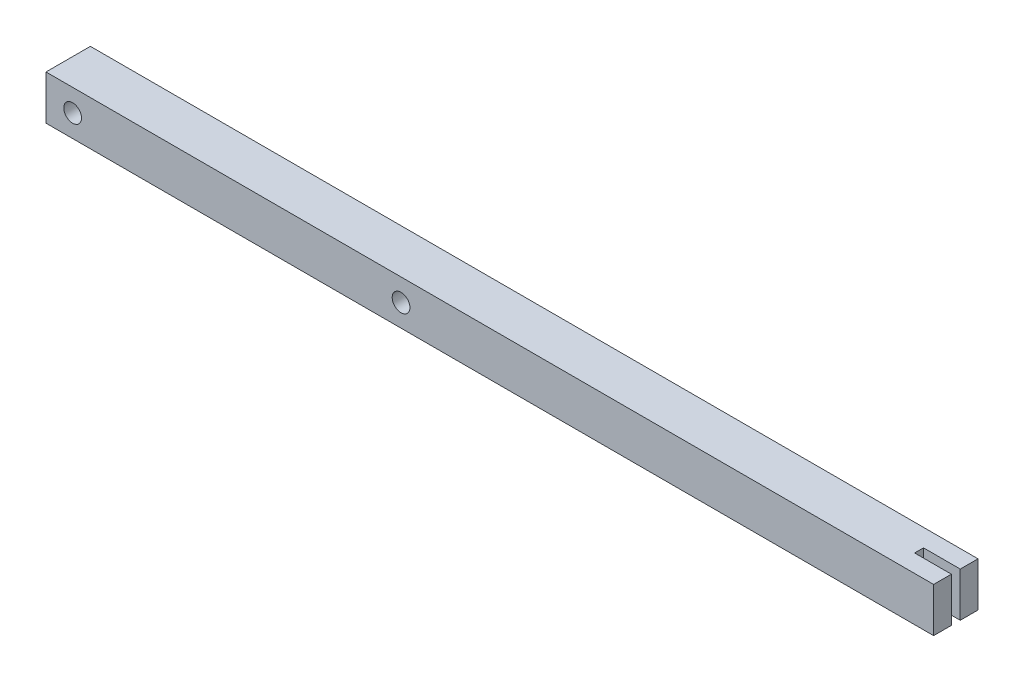
ISO-10303-21;
HEADER;
FILE_DESCRIPTION(('STEP AP214'),'2;1');
FILE_NAME('part.step','',(''),(''),'','','');
FILE_SCHEMA(('AUTOMOTIVE_DESIGN { 1 0 10303 214 1 1 1 1 }'));
ENDSEC;
DATA;
#1=APPLICATION_CONTEXT('core data for automotive mechanical design processes');
#2=APPLICATION_PROTOCOL_DEFINITION('international standard','automotive_design',2000,#1);
#3=PRODUCT_CONTEXT('',#1,'mechanical');
#4=PRODUCT('Part','Part','',(#3));
#5=PRODUCT_RELATED_PRODUCT_CATEGORY('part','',(#4));
#6=PRODUCT_DEFINITION_FORMATION('','',#4);
#7=PRODUCT_DEFINITION_CONTEXT('part definition',#1,'design');
#8=PRODUCT_DEFINITION('design','',#6,#7);
#9=PRODUCT_DEFINITION_SHAPE('','',#8);
#10=(LENGTH_UNIT() NAMED_UNIT(*) SI_UNIT(.MILLI.,.METRE.));
#11=(NAMED_UNIT(*) PLANE_ANGLE_UNIT() SI_UNIT($,.RADIAN.));
#12=(NAMED_UNIT(*) SI_UNIT($,.STERADIAN.) SOLID_ANGLE_UNIT());
#13=UNCERTAINTY_MEASURE_WITH_UNIT(LENGTH_MEASURE(1.E-05),#10,'distance_accuracy_value','');
#14=(GEOMETRIC_REPRESENTATION_CONTEXT(3) GLOBAL_UNCERTAINTY_ASSIGNED_CONTEXT((#13)) GLOBAL_UNIT_ASSIGNED_CONTEXT((#10,
#11,#12)) REPRESENTATION_CONTEXT('',''));
#15=CARTESIAN_POINT('',(0.,0.,0.));
#16=DIRECTION('',(0.,0.,1.));
#17=DIRECTION('',(1.,0.,0.));
#18=AXIS2_PLACEMENT_3D('',#15,#16,#17);
#19=CARTESIAN_POINT('',(250.,25.,12.5));
#20=DIRECTION('',(-1.,0.,0.));
#21=DIRECTION('',(0.,0.,1.));
#22=AXIS2_PLACEMENT_3D('',#19,#20,#21);
#23=PLANE('',#22);
#24=DIRECTION('',(0.,0.,-1.));
#25=VECTOR('',#24,1.);
#26=CARTESIAN_POINT('',(250.,25.,12.5));
#27=LINE('',#26,#25);
#28=CARTESIAN_POINT('',(250.,25.,-2.5));
#29=VERTEX_POINT('',#28);
#30=CARTESIAN_POINT('',(250.,25.,-12.5));
#31=VERTEX_POINT('',#30);
#32=EDGE_CURVE('E155',#29,#31,#27,.T.);
#33=ORIENTED_EDGE('',*,*,#32,.F.);
#34=DIRECTION('',(0.,-1.,0.));
#35=VECTOR('',#34,1.);
#36=CARTESIAN_POINT('',(250.,25.,-2.5));
#37=LINE('',#36,#35);
#38=CARTESIAN_POINT('',(250.,0.,-2.5));
#39=VERTEX_POINT('',#38);
#40=EDGE_CURVE('E136',#29,#39,#37,.T.);
#41=ORIENTED_EDGE('',*,*,#40,.T.);
#42=DIRECTION('',(0.,0.,-1.));
#43=VECTOR('',#42,1.);
#44=CARTESIAN_POINT('',(250.,0.,12.5));
#45=LINE('',#44,#43);
#46=CARTESIAN_POINT('',(250.,0.,-12.5));
#47=VERTEX_POINT('',#46);
#48=EDGE_CURVE('E165',#39,#47,#45,.T.);
#49=ORIENTED_EDGE('',*,*,#48,.T.);
#50=DIRECTION('',(0.,-1.,0.));
#51=VECTOR('',#50,1.);
#52=CARTESIAN_POINT('',(250.,25.,-12.5));
#53=LINE('',#52,#51);
#54=EDGE_CURVE('E170',#31,#47,#53,.T.);
#55=ORIENTED_EDGE('',*,*,#54,.F.);
#56=EDGE_LOOP('',(#33,#41,#49,#55));
#57=FACE_BOUND('',#56,.T.);
#58=ADVANCED_FACE('F33',(#57),#23,.F.);
#59=CARTESIAN_POINT('',(-250.,25.,12.5));
#60=DIRECTION('',(1.,0.,0.));
#61=DIRECTION('',(0.,0.,-1.));
#62=AXIS2_PLACEMENT_3D('',#59,#60,#61);
#63=PLANE('',#62);
#64=DIRECTION('',(0.,0.,1.));
#65=VECTOR('',#64,1.);
#66=CARTESIAN_POINT('',(-250.,0.,12.5));
#67=LINE('',#66,#65);
#68=CARTESIAN_POINT('',(-250.,0.,-12.5));
#69=VERTEX_POINT('',#68);
#70=CARTESIAN_POINT('',(-250.,0.,12.5));
#71=VERTEX_POINT('',#70);
#72=EDGE_CURVE('E149',#69,#71,#67,.T.);
#73=ORIENTED_EDGE('',*,*,#72,.T.);
#74=DIRECTION('',(0.,-1.,0.));
#75=VECTOR('',#74,1.);
#76=CARTESIAN_POINT('',(-250.,25.,12.5));
#77=LINE('',#76,#75);
#78=CARTESIAN_POINT('',(-250.,25.,12.5));
#79=VERTEX_POINT('',#78);
#80=EDGE_CURVE('E41',#79,#71,#77,.T.);
#81=ORIENTED_EDGE('',*,*,#80,.F.);
#82=DIRECTION('',(0.,0.,1.));
#83=VECTOR('',#82,1.);
#84=CARTESIAN_POINT('',(-250.,25.,12.5));
#85=LINE('',#84,#83);
#86=CARTESIAN_POINT('',(-250.,25.,-12.5));
#87=VERTEX_POINT('',#86);
#88=EDGE_CURVE('E152',#87,#79,#85,.T.);
#89=ORIENTED_EDGE('',*,*,#88,.F.);
#90=DIRECTION('',(0.,-1.,0.));
#91=VECTOR('',#90,1.);
#92=CARTESIAN_POINT('',(-250.,25.,-12.5));
#93=LINE('',#92,#91);
#94=EDGE_CURVE('E160',#87,#69,#93,.T.);
#95=ORIENTED_EDGE('',*,*,#94,.T.);
#96=EDGE_LOOP('',(#73,#81,#89,#95));
#97=FACE_BOUND('',#96,.T.);
#98=ADVANCED_FACE('F35',(#97),#63,.F.);
#99=CARTESIAN_POINT('',(250.,25.,12.5));
#100=DIRECTION('',(0.,0.,-1.));
#101=DIRECTION('',(-1.,0.,0.));
#102=AXIS2_PLACEMENT_3D('',#99,#100,#101);
#103=PLANE('',#102);
#104=CARTESIAN_POINT('',(-50.,12.5,12.5));
#105=DIRECTION('',(0.,0.,1.));
#106=DIRECTION('',(1.,0.,0.));
#107=AXIS2_PLACEMENT_3D('',#104,#105,#106);
#108=CIRCLE('',#107,4.99999999999999);
#109=CARTESIAN_POINT('',(-45.,12.5,12.5));
#110=VERTEX_POINT('',#109);
#111=EDGE_CURVE('E139',#110,#110,#108,.T.);
#112=ORIENTED_EDGE('',*,*,#111,.F.);
#113=EDGE_LOOP('',(#112));
#114=FACE_BOUND('',#113,.T.);
#115=CARTESIAN_POINT('',(-235.,12.5,12.5));
#116=DIRECTION('',(0.,0.,1.));
#117=DIRECTION('',(1.,0.,0.));
#118=AXIS2_PLACEMENT_3D('',#115,#116,#117);
#119=CIRCLE('',#118,4.99999999999999);
#120=CARTESIAN_POINT('',(-230.,12.5,12.5));
#121=VERTEX_POINT('',#120);
#122=EDGE_CURVE('E143',#121,#121,#119,.T.);
#123=ORIENTED_EDGE('',*,*,#122,.F.);
#124=EDGE_LOOP('',(#123));
#125=FACE_BOUND('',#124,.T.);
#126=DIRECTION('',(1.,0.,0.));
#127=VECTOR('',#126,1.);
#128=CARTESIAN_POINT('',(250.,0.,12.5));
#129=LINE('',#128,#127);
#130=CARTESIAN_POINT('',(250.,0.,12.5));
#131=VERTEX_POINT('',#130);
#132=EDGE_CURVE('E163',#71,#131,#129,.T.);
#133=ORIENTED_EDGE('',*,*,#132,.T.);
#134=DIRECTION('',(0.,-1.,0.));
#135=VECTOR('',#134,1.);
#136=CARTESIAN_POINT('',(250.,25.,12.5));
#137=LINE('',#136,#135);
#138=CARTESIAN_POINT('',(250.,25.,12.5));
#139=VERTEX_POINT('',#138);
#140=EDGE_CURVE('E172',#139,#131,#137,.T.);
#141=ORIENTED_EDGE('',*,*,#140,.F.);
#142=DIRECTION('',(1.,0.,0.));
#143=VECTOR('',#142,1.);
#144=CARTESIAN_POINT('',(250.,25.,12.5));
#145=LINE('',#144,#143);
#146=EDGE_CURVE('E86',#79,#139,#145,.T.);
#147=ORIENTED_EDGE('',*,*,#146,.F.);
#148=ORIENTED_EDGE('',*,*,#80,.T.);
#149=EDGE_LOOP('',(#133,#141,#147,#148));
#150=FACE_BOUND('',#149,.T.);
#151=ADVANCED_FACE('F175',(#114,#125,#150),#103,.F.);
#152=CARTESIAN_POINT('',(250.,0.,2.5));
#153=VERTEX_POINT('',#152);
#154=EDGE_CURVE('E166',#131,#153,#45,.T.);
#155=ORIENTED_EDGE('',*,*,#154,.T.);
#156=DIRECTION('',(0.,1.,0.));
#157=VECTOR('',#156,1.);
#158=CARTESIAN_POINT('',(250.,25.,2.5));
#159=LINE('',#158,#157);
#160=CARTESIAN_POINT('',(250.,25.,2.5));
#161=VERTEX_POINT('',#160);
#162=EDGE_CURVE('E48',#153,#161,#159,.T.);
#163=ORIENTED_EDGE('',*,*,#162,.T.);
#164=EDGE_CURVE('E156',#139,#161,#27,.T.);
#165=ORIENTED_EDGE('',*,*,#164,.F.);
#166=ORIENTED_EDGE('',*,*,#140,.T.);
#167=EDGE_LOOP('',(#155,#163,#165,#166));
#168=FACE_BOUND('',#167,.T.);
#169=ADVANCED_FACE('F180',(#168),#23,.F.);
#170=CARTESIAN_POINT('',(250.,25.,-12.5));
#171=DIRECTION('',(0.,0.,1.));
#172=DIRECTION('',(1.,0.,0.));
#173=AXIS2_PLACEMENT_3D('',#170,#171,#172);
#174=PLANE('',#173);
#175=CARTESIAN_POINT('',(-50.,12.5,-12.5));
#176=DIRECTION('',(0.,0.,1.));
#177=DIRECTION('',(1.,0.,0.));
#178=AXIS2_PLACEMENT_3D('',#175,#176,#177);
#179=CIRCLE('',#178,4.99999999999999);
#180=CARTESIAN_POINT('',(-45.,12.5,-12.5));
#181=VERTEX_POINT('',#180);
#182=EDGE_CURVE('E140',#181,#181,#179,.T.);
#183=ORIENTED_EDGE('',*,*,#182,.T.);
#184=EDGE_LOOP('',(#183));
#185=FACE_BOUND('',#184,.T.);
#186=CARTESIAN_POINT('',(-235.,12.5,-12.5));
#187=DIRECTION('',(0.,0.,1.));
#188=DIRECTION('',(1.,0.,0.));
#189=AXIS2_PLACEMENT_3D('',#186,#187,#188);
#190=CIRCLE('',#189,4.99999999999999);
#191=CARTESIAN_POINT('',(-230.,12.5,-12.5));
#192=VERTEX_POINT('',#191);
#193=EDGE_CURVE('E146',#192,#192,#190,.T.);
#194=ORIENTED_EDGE('',*,*,#193,.T.);
#195=EDGE_LOOP('',(#194));
#196=FACE_BOUND('',#195,.T.);
#197=DIRECTION('',(-1.,0.,0.));
#198=VECTOR('',#197,1.);
#199=CARTESIAN_POINT('',(250.,0.,-12.5));
#200=LINE('',#199,#198);
#201=EDGE_CURVE('E78',#47,#69,#200,.T.);
#202=ORIENTED_EDGE('',*,*,#201,.T.);
#203=ORIENTED_EDGE('',*,*,#94,.F.);
#204=DIRECTION('',(-1.,0.,0.));
#205=VECTOR('',#204,1.);
#206=CARTESIAN_POINT('',(250.,25.,-12.5));
#207=LINE('',#206,#205);
#208=EDGE_CURVE('E57',#31,#87,#207,.T.);
#209=ORIENTED_EDGE('',*,*,#208,.F.);
#210=ORIENTED_EDGE('',*,*,#54,.T.);
#211=EDGE_LOOP('',(#202,#203,#209,#210));
#212=FACE_BOUND('',#211,.T.);
#213=ADVANCED_FACE('F188',(#185,#196,#212),#174,.F.);
#214=CARTESIAN_POINT('',(0.,25.,0.));
#215=DIRECTION('',(0.,1.,0.));
#216=DIRECTION('',(0.,0.,1.));
#217=AXIS2_PLACEMENT_3D('',#214,#215,#216);
#218=PLANE('',#217);
#219=DIRECTION('',(-1.,0.,0.));
#220=VECTOR('',#219,1.);
#221=CARTESIAN_POINT('',(229.29580242492,25.,-2.5));
#222=LINE('',#221,#220);
#223=CARTESIAN_POINT('',(229.29580242492,25.,-2.5));
#224=VERTEX_POINT('',#223);
#225=EDGE_CURVE('E127',#29,#224,#222,.T.);
#226=ORIENTED_EDGE('',*,*,#225,.F.);
#227=ORIENTED_EDGE('',*,*,#32,.T.);
#228=ORIENTED_EDGE('',*,*,#208,.T.);
#229=ORIENTED_EDGE('',*,*,#88,.T.);
#230=ORIENTED_EDGE('',*,*,#146,.T.);
#231=ORIENTED_EDGE('',*,*,#164,.T.);
#232=DIRECTION('',(1.,0.,0.));
#233=VECTOR('',#232,1.);
#234=CARTESIAN_POINT('',(229.29580242492,25.,2.5));
#235=LINE('',#234,#233);
#236=CARTESIAN_POINT('',(229.29580242492,25.,2.5));
#237=VERTEX_POINT('',#236);
#238=EDGE_CURVE('E129',#237,#161,#235,.T.);
#239=ORIENTED_EDGE('',*,*,#238,.F.);
#240=DIRECTION('',(0.,0.,1.));
#241=VECTOR('',#240,1.);
#242=CARTESIAN_POINT('',(229.29580242492,25.,2.5));
#243=LINE('',#242,#241);
#244=EDGE_CURVE('E115',#224,#237,#243,.T.);
#245=ORIENTED_EDGE('',*,*,#244,.F.);
#246=EDGE_LOOP('',(#226,#227,#228,#229,#230,#231,#239,#245));
#247=FACE_BOUND('',#246,.T.);
#248=ADVANCED_FACE('F183',(#247),#218,.T.);
#249=CARTESIAN_POINT('',(0.,0.,0.));
#250=DIRECTION('',(0.,1.,0.));
#251=DIRECTION('',(0.,0.,1.));
#252=AXIS2_PLACEMENT_3D('',#249,#250,#251);
#253=PLANE('',#252);
#254=ORIENTED_EDGE('',*,*,#48,.F.);
#255=DIRECTION('',(-1.,0.,0.));
#256=VECTOR('',#255,1.);
#257=CARTESIAN_POINT('',(0.,0.,-2.5));
#258=LINE('',#257,#256);
#259=CARTESIAN_POINT('',(229.29580242492,0.,-2.5));
#260=VERTEX_POINT('',#259);
#261=EDGE_CURVE('E11',#39,#260,#258,.T.);
#262=ORIENTED_EDGE('',*,*,#261,.T.);
#263=DIRECTION('',(0.,0.,1.));
#264=VECTOR('',#263,1.);
#265=CARTESIAN_POINT('',(229.29580242492,0.,2.5));
#266=LINE('',#265,#264);
#267=CARTESIAN_POINT('',(229.29580242492,0.,2.5));
#268=VERTEX_POINT('',#267);
#269=EDGE_CURVE('E113',#260,#268,#266,.T.);
#270=ORIENTED_EDGE('',*,*,#269,.T.);
#271=DIRECTION('',(1.,0.,0.));
#272=VECTOR('',#271,1.);
#273=CARTESIAN_POINT('',(229.29580242492,0.,2.5));
#274=LINE('',#273,#272);
#275=EDGE_CURVE('E118',#268,#153,#274,.T.);
#276=ORIENTED_EDGE('',*,*,#275,.T.);
#277=ORIENTED_EDGE('',*,*,#154,.F.);
#278=ORIENTED_EDGE('',*,*,#132,.F.);
#279=ORIENTED_EDGE('',*,*,#72,.F.);
#280=ORIENTED_EDGE('',*,*,#201,.F.);
#281=EDGE_LOOP('',(#254,#262,#270,#276,#277,#278,#279,#280));
#282=FACE_BOUND('',#281,.T.);
#283=ADVANCED_FACE('F126',(#282),#253,.F.);
#284=CARTESIAN_POINT('',(-235.,12.5,-12.5));
#285=DIRECTION('',(0.,0.,1.));
#286=DIRECTION('',(1.,0.,0.));
#287=AXIS2_PLACEMENT_3D('',#284,#285,#286);
#288=CYLINDRICAL_SURFACE('',#287,4.99999999999999);
#289=ORIENTED_EDGE('',*,*,#193,.F.);
#290=EDGE_LOOP('',(#289));
#291=FACE_BOUND('',#290,.T.);
#292=ORIENTED_EDGE('',*,*,#122,.T.);
#293=EDGE_LOOP('',(#292));
#294=FACE_BOUND('',#293,.T.);
#295=ADVANCED_FACE('F212',(#291,#294),#288,.F.);
#296=CARTESIAN_POINT('',(-50.,12.5,-12.5));
#297=DIRECTION('',(0.,0.,1.));
#298=DIRECTION('',(1.,0.,0.));
#299=AXIS2_PLACEMENT_3D('',#296,#297,#298);
#300=CYLINDRICAL_SURFACE('',#299,4.99999999999999);
#301=ORIENTED_EDGE('',*,*,#182,.F.);
#302=EDGE_LOOP('',(#301));
#303=FACE_BOUND('',#302,.T.);
#304=ORIENTED_EDGE('',*,*,#111,.T.);
#305=EDGE_LOOP('',(#304));
#306=FACE_BOUND('',#305,.T.);
#307=ADVANCED_FACE('F214',(#303,#306),#300,.F.);
#308=CARTESIAN_POINT('',(229.29580242492,0.,-2.5));
#309=DIRECTION('',(0.,0.,-1.));
#310=DIRECTION('',(-1.,0.,0.));
#311=AXIS2_PLACEMENT_3D('',#308,#309,#310);
#312=PLANE('',#311);
#313=ORIENTED_EDGE('',*,*,#225,.T.);
#314=DIRECTION('',(0.,1.,0.));
#315=VECTOR('',#314,1.);
#316=CARTESIAN_POINT('',(229.29580242492,0.,-2.5));
#317=LINE('',#316,#315);
#318=EDGE_CURVE('E117',#260,#224,#317,.T.);
#319=ORIENTED_EDGE('',*,*,#318,.F.);
#320=ORIENTED_EDGE('',*,*,#261,.F.);
#321=ORIENTED_EDGE('',*,*,#40,.F.);
#322=EDGE_LOOP('',(#313,#319,#320,#321));
#323=FACE_BOUND('',#322,.T.);
#324=ADVANCED_FACE('F221',(#323),#312,.F.);
#325=CARTESIAN_POINT('',(229.29580242492,0.,2.5));
#326=DIRECTION('',(0.,0.,1.));
#327=DIRECTION('',(1.,0.,0.));
#328=AXIS2_PLACEMENT_3D('',#325,#326,#327);
#329=PLANE('',#328);
#330=ORIENTED_EDGE('',*,*,#275,.F.);
#331=DIRECTION('',(0.,1.,0.));
#332=VECTOR('',#331,1.);
#333=CARTESIAN_POINT('',(229.29580242492,0.,2.5));
#334=LINE('',#333,#332);
#335=EDGE_CURVE('E109',#268,#237,#334,.T.);
#336=ORIENTED_EDGE('',*,*,#335,.T.);
#337=ORIENTED_EDGE('',*,*,#238,.T.);
#338=ORIENTED_EDGE('',*,*,#162,.F.);
#339=EDGE_LOOP('',(#330,#336,#337,#338));
#340=FACE_BOUND('',#339,.T.);
#341=ADVANCED_FACE('F120',(#340),#329,.F.);
#342=CARTESIAN_POINT('',(229.29580242492,0.,2.5));
#343=DIRECTION('',(-1.,0.,0.));
#344=DIRECTION('',(0.,0.,1.));
#345=AXIS2_PLACEMENT_3D('',#342,#343,#344);
#346=PLANE('',#345);
#347=ORIENTED_EDGE('',*,*,#244,.T.);
#348=ORIENTED_EDGE('',*,*,#335,.F.);
#349=ORIENTED_EDGE('',*,*,#269,.F.);
#350=ORIENTED_EDGE('',*,*,#318,.T.);
#351=EDGE_LOOP('',(#347,#348,#349,#350));
#352=FACE_BOUND('',#351,.T.);
#353=ADVANCED_FACE('F110',(#352),#346,.F.);
#354=CLOSED_SHELL('',(#58,#98,#151,#169,#213,#248,#283,#295,#307,#324,#341,#353));
#355=MANIFOLD_SOLID_BREP('B2',#354);
#356=ADVANCED_BREP_SHAPE_REPRESENTATION('',(#18,#355),#14);
#357=SHAPE_DEFINITION_REPRESENTATION(#9,#356);
ENDSEC;
END-ISO-10303-21;
